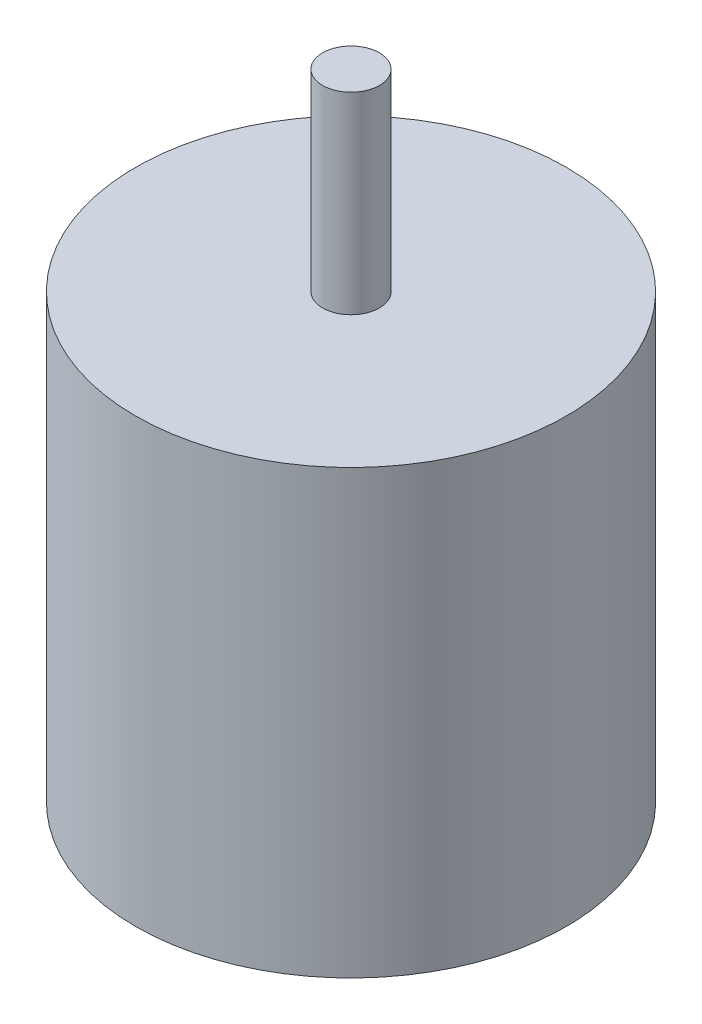
ISO-10303-21;
HEADER;
FILE_DESCRIPTION(('STEP AP214'),'2;1');
FILE_NAME('part.step','',(''),(''),'','','');
FILE_SCHEMA(('AUTOMOTIVE_DESIGN { 1 0 10303 214 1 1 1 1 }'));
ENDSEC;
DATA;
#1=APPLICATION_CONTEXT('core data for automotive mechanical design processes');
#2=APPLICATION_PROTOCOL_DEFINITION('international standard','automotive_design',2000,#1);
#3=PRODUCT_CONTEXT('',#1,'mechanical');
#4=PRODUCT('Part','Part','',(#3));
#5=PRODUCT_RELATED_PRODUCT_CATEGORY('part','',(#4));
#6=PRODUCT_DEFINITION_FORMATION('','',#4);
#7=PRODUCT_DEFINITION_CONTEXT('part definition',#1,'design');
#8=PRODUCT_DEFINITION('design','',#6,#7);
#9=PRODUCT_DEFINITION_SHAPE('','',#8);
#10=(LENGTH_UNIT() NAMED_UNIT(*) SI_UNIT(.MILLI.,.METRE.));
#11=(NAMED_UNIT(*) PLANE_ANGLE_UNIT() SI_UNIT($,.RADIAN.));
#12=(NAMED_UNIT(*) SI_UNIT($,.STERADIAN.) SOLID_ANGLE_UNIT());
#13=UNCERTAINTY_MEASURE_WITH_UNIT(LENGTH_MEASURE(1.E-05),#10,'distance_accuracy_value','');
#14=(GEOMETRIC_REPRESENTATION_CONTEXT(3) GLOBAL_UNCERTAINTY_ASSIGNED_CONTEXT((#13)) GLOBAL_UNIT_ASSIGNED_CONTEXT((#10,
#11,#12)) REPRESENTATION_CONTEXT('',''));
#15=CARTESIAN_POINT('',(0.,0.,0.));
#16=DIRECTION('',(0.,0.,1.));
#17=DIRECTION('',(1.,0.,0.));
#18=AXIS2_PLACEMENT_3D('',#15,#16,#17);
#19=CARTESIAN_POINT('',(0.,39.,0.));
#20=DIRECTION('',(0.,-1.,0.));
#21=DIRECTION('',(0.,0.,1.));
#22=AXIS2_PLACEMENT_3D('',#19,#20,#21);
#23=CYLINDRICAL_SURFACE('',#22,19.);
#24=CARTESIAN_POINT('',(0.,39.,0.));
#25=DIRECTION('',(0.,-1.,0.));
#26=DIRECTION('',(0.,0.,-1.));
#27=AXIS2_PLACEMENT_3D('',#24,#25,#26);
#28=CIRCLE('',#27,19.);
#29=CARTESIAN_POINT('',(0.,39.,-19.));
#30=VERTEX_POINT('',#29);
#31=EDGE_CURVE('E11',#30,#30,#28,.T.);
#32=ORIENTED_EDGE('',*,*,#31,.T.);
#33=EDGE_LOOP('',(#32));
#34=FACE_BOUND('',#33,.T.);
#35=CARTESIAN_POINT('',(0.,0.,0.));
#36=DIRECTION('',(0.,-1.,0.));
#37=DIRECTION('',(0.,0.,-1.));
#38=AXIS2_PLACEMENT_3D('',#35,#36,#37);
#39=CIRCLE('',#38,19.);
#40=CARTESIAN_POINT('',(0.,0.,-19.));
#41=VERTEX_POINT('',#40);
#42=EDGE_CURVE('E40',#41,#41,#39,.T.);
#43=ORIENTED_EDGE('',*,*,#42,.F.);
#44=EDGE_LOOP('',(#43));
#45=FACE_BOUND('',#44,.T.);
#46=ADVANCED_FACE('F37',(#34,#45),#23,.T.);
#47=CARTESIAN_POINT('',(0.,39.,0.));
#48=DIRECTION('',(0.,1.,0.));
#49=DIRECTION('',(0.,0.,-1.));
#50=AXIS2_PLACEMENT_3D('',#47,#48,#49);
#51=PLANE('',#50);
#52=CARTESIAN_POINT('',(0.,39.,0.));
#53=DIRECTION('',(0.,-1.,0.));
#54=DIRECTION('',(0.,0.,-1.));
#55=AXIS2_PLACEMENT_3D('',#52,#53,#54);
#56=CIRCLE('',#55,2.5);
#57=CARTESIAN_POINT('',(0.,39.,-2.5));
#58=VERTEX_POINT('',#57);
#59=EDGE_CURVE('E90',#58,#58,#56,.T.);
#60=ORIENTED_EDGE('',*,*,#59,.T.);
#61=EDGE_LOOP('',(#60));
#62=FACE_BOUND('',#61,.T.);
#63=ORIENTED_EDGE('',*,*,#31,.F.);
#64=EDGE_LOOP('',(#63));
#65=FACE_BOUND('',#64,.T.);
#66=ADVANCED_FACE('F97',(#62,#65),#51,.T.);
#67=CARTESIAN_POINT('',(0.,0.,0.));
#68=DIRECTION('',(0.,1.,0.));
#69=DIRECTION('',(0.,0.,-1.));
#70=AXIS2_PLACEMENT_3D('',#67,#68,#69);
#71=PLANE('',#70);
#72=CARTESIAN_POINT('',(-8.50000000000001,0.,-8.));
#73=DIRECTION('',(0.,1.,0.));
#74=DIRECTION('',(0.,0.,1.));
#75=AXIS2_PLACEMENT_3D('',#72,#73,#74);
#76=CIRCLE('',#75,1.24999999999999);
#77=CARTESIAN_POINT('',(-8.50000000000001,0.,-6.75000000000001));
#78=VERTEX_POINT('',#77);
#79=EDGE_CURVE('E68',#78,#78,#76,.T.);
#80=ORIENTED_EDGE('',*,*,#79,.T.);
#81=EDGE_LOOP('',(#80));
#82=FACE_BOUND('',#81,.T.);
#83=CARTESIAN_POINT('',(-8.50000000000106,0.,7.99999999999994));
#84=DIRECTION('',(0.,1.,0.));
#85=DIRECTION('',(0.,0.,1.));
#86=AXIS2_PLACEMENT_3D('',#83,#84,#85);
#87=CIRCLE('',#86,1.24999999999999);
#88=CARTESIAN_POINT('',(-8.50000000000106,0.,9.24999999999993));
#89=VERTEX_POINT('',#88);
#90=EDGE_CURVE('E67',#89,#89,#87,.T.);
#91=ORIENTED_EDGE('',*,*,#90,.T.);
#92=EDGE_LOOP('',(#91));
#93=FACE_BOUND('',#92,.T.);
#94=CARTESIAN_POINT('',(8.50000000000001,0.,8.00000000000001));
#95=DIRECTION('',(0.,1.,0.));
#96=DIRECTION('',(0.,0.,1.));
#97=AXIS2_PLACEMENT_3D('',#94,#95,#96);
#98=CIRCLE('',#97,1.24999999999999);
#99=CARTESIAN_POINT('',(8.50000000000001,0.,9.25));
#100=VERTEX_POINT('',#99);
#101=EDGE_CURVE('E78',#100,#100,#98,.T.);
#102=ORIENTED_EDGE('',*,*,#101,.T.);
#103=EDGE_LOOP('',(#102));
#104=FACE_BOUND('',#103,.T.);
#105=CARTESIAN_POINT('',(8.50000000000092,0.,-8.));
#106=DIRECTION('',(0.,1.,0.));
#107=DIRECTION('',(0.,0.,1.));
#108=AXIS2_PLACEMENT_3D('',#105,#106,#107);
#109=CIRCLE('',#108,1.24999999999999);
#110=CARTESIAN_POINT('',(8.50000000000092,0.,-6.75000000000001));
#111=VERTEX_POINT('',#110);
#112=EDGE_CURVE('E84',#111,#111,#109,.T.);
#113=ORIENTED_EDGE('',*,*,#112,.T.);
#114=EDGE_LOOP('',(#113));
#115=FACE_BOUND('',#114,.T.);
#116=ORIENTED_EDGE('',*,*,#42,.T.);
#117=EDGE_LOOP('',(#116));
#118=FACE_BOUND('',#117,.T.);
#119=ADVANCED_FACE('F103',(#82,#93,#104,#115,#118),#71,.F.);
#120=CARTESIAN_POINT('',(0.,56.,0.));
#121=DIRECTION('',(0.,-1.,0.));
#122=DIRECTION('',(0.,0.,1.));
#123=AXIS2_PLACEMENT_3D('',#120,#121,#122);
#124=CYLINDRICAL_SURFACE('',#123,2.5);
#125=CARTESIAN_POINT('',(0.,56.,0.));
#126=DIRECTION('',(0.,-1.,0.));
#127=DIRECTION('',(0.,0.,-1.));
#128=AXIS2_PLACEMENT_3D('',#125,#126,#127);
#129=CIRCLE('',#128,2.5);
#130=CARTESIAN_POINT('',(0.,56.,-2.5));
#131=VERTEX_POINT('',#130);
#132=EDGE_CURVE('E91',#131,#131,#129,.T.);
#133=ORIENTED_EDGE('',*,*,#132,.T.);
#134=EDGE_LOOP('',(#133));
#135=FACE_BOUND('',#134,.T.);
#136=ORIENTED_EDGE('',*,*,#59,.F.);
#137=EDGE_LOOP('',(#136));
#138=FACE_BOUND('',#137,.T.);
#139=ADVANCED_FACE('F100',(#135,#138),#124,.T.);
#140=CARTESIAN_POINT('',(0.,56.,0.));
#141=DIRECTION('',(0.,1.,0.));
#142=DIRECTION('',(0.,0.,-1.));
#143=AXIS2_PLACEMENT_3D('',#140,#141,#142);
#144=PLANE('',#143);
#145=ORIENTED_EDGE('',*,*,#132,.F.);
#146=EDGE_LOOP('',(#145));
#147=FACE_BOUND('',#146,.T.);
#148=ADVANCED_FACE('F102',(#147),#144,.T.);
#149=CARTESIAN_POINT('',(8.50000000000092,7.50000000000001,-8.));
#150=DIRECTION('',(0.,-1.,0.));
#151=DIRECTION('',(0.,0.,1.));
#152=AXIS2_PLACEMENT_3D('',#149,#150,#151);
#153=CONICAL_SURFACE('',#152,1.24999999999999,1.02974425867665);
#154=CARTESIAN_POINT('',(8.50000000000092,8.25107577378448,-8.));
#155=VERTEX_POINT('',#154);
#156=VERTEX_LOOP('',#155);
#157=FACE_BOUND('',#156,.T.);
#158=CARTESIAN_POINT('',(8.50000000000092,7.50000000000001,-8.));
#159=DIRECTION('',(0.,1.,0.));
#160=DIRECTION('',(0.,0.,1.));
#161=AXIS2_PLACEMENT_3D('',#158,#159,#160);
#162=CIRCLE('',#161,1.24999999999999);
#163=CARTESIAN_POINT('',(8.50000000000092,7.50000000000001,-6.75000000000001));
#164=VERTEX_POINT('',#163);
#165=EDGE_CURVE('E87',#164,#164,#162,.T.);
#166=ORIENTED_EDGE('',*,*,#165,.F.);
#167=EDGE_LOOP('',(#166));
#168=FACE_BOUND('',#167,.T.);
#169=ADVANCED_FACE('F110',(#157,#168),#153,.F.);
#170=CARTESIAN_POINT('',(8.50000000000092,0.,-8.));
#171=DIRECTION('',(0.,-1.,0.));
#172=DIRECTION('',(0.,0.,1.));
#173=AXIS2_PLACEMENT_3D('',#170,#171,#172);
#174=CYLINDRICAL_SURFACE('',#173,1.24999999999999);
#175=ORIENTED_EDGE('',*,*,#165,.T.);
#176=EDGE_LOOP('',(#175));
#177=FACE_BOUND('',#176,.T.);
#178=ORIENTED_EDGE('',*,*,#112,.F.);
#179=EDGE_LOOP('',(#178));
#180=FACE_BOUND('',#179,.T.);
#181=ADVANCED_FACE('F150',(#177,#180),#174,.F.);
#182=CARTESIAN_POINT('',(8.50000000000001,7.50000000000001,8.00000000000001));
#183=DIRECTION('',(0.,-1.,0.));
#184=DIRECTION('',(0.,0.,1.));
#185=AXIS2_PLACEMENT_3D('',#182,#183,#184);
#186=CONICAL_SURFACE('',#185,1.24999999999999,1.02974425867665);
#187=CARTESIAN_POINT('',(8.50000000000001,8.25107577378448,8.00000000000001));
#188=VERTEX_POINT('',#187);
#189=VERTEX_LOOP('',#188);
#190=FACE_BOUND('',#189,.T.);
#191=CARTESIAN_POINT('',(8.50000000000001,7.50000000000001,8.00000000000001));
#192=DIRECTION('',(0.,1.,0.));
#193=DIRECTION('',(0.,0.,1.));
#194=AXIS2_PLACEMENT_3D('',#191,#192,#193);
#195=CIRCLE('',#194,1.24999999999999);
#196=CARTESIAN_POINT('',(8.50000000000001,7.50000000000001,9.25));
#197=VERTEX_POINT('',#196);
#198=EDGE_CURVE('E81',#197,#197,#195,.T.);
#199=ORIENTED_EDGE('',*,*,#198,.F.);
#200=EDGE_LOOP('',(#199));
#201=FACE_BOUND('',#200,.T.);
#202=ADVANCED_FACE('F159',(#190,#201),#186,.F.);
#203=CARTESIAN_POINT('',(8.50000000000001,0.,8.00000000000001));
#204=DIRECTION('',(0.,-1.,0.));
#205=DIRECTION('',(0.,0.,1.));
#206=AXIS2_PLACEMENT_3D('',#203,#204,#205);
#207=CYLINDRICAL_SURFACE('',#206,1.24999999999999);
#208=ORIENTED_EDGE('',*,*,#198,.T.);
#209=EDGE_LOOP('',(#208));
#210=FACE_BOUND('',#209,.T.);
#211=ORIENTED_EDGE('',*,*,#101,.F.);
#212=EDGE_LOOP('',(#211));
#213=FACE_BOUND('',#212,.T.);
#214=ADVANCED_FACE('F169',(#210,#213),#207,.F.);
#215=CARTESIAN_POINT('',(-8.50000000000106,7.50000000000001,7.99999999999994));
#216=DIRECTION('',(0.,-1.,0.));
#217=DIRECTION('',(0.,0.,1.));
#218=AXIS2_PLACEMENT_3D('',#215,#216,#217);
#219=CONICAL_SURFACE('',#218,1.24999999999999,1.02974425867665);
#220=CARTESIAN_POINT('',(-8.50000000000109,8.25107577378448,7.99999999999994));
#221=VERTEX_POINT('',#220);
#222=VERTEX_LOOP('',#221);
#223=FACE_BOUND('',#222,.T.);
#224=CARTESIAN_POINT('',(-8.50000000000106,7.50000000000001,7.99999999999994));
#225=DIRECTION('',(0.,1.,0.));
#226=DIRECTION('',(0.,0.,1.));
#227=AXIS2_PLACEMENT_3D('',#224,#225,#226);
#228=CIRCLE('',#227,1.24999999999999);
#229=CARTESIAN_POINT('',(-8.50000000000106,7.50000000000001,9.24999999999993));
#230=VERTEX_POINT('',#229);
#231=EDGE_CURVE('E71',#230,#230,#228,.T.);
#232=ORIENTED_EDGE('',*,*,#231,.F.);
#233=EDGE_LOOP('',(#232));
#234=FACE_BOUND('',#233,.T.);
#235=ADVANCED_FACE('F178',(#223,#234),#219,.F.);
#236=CARTESIAN_POINT('',(-8.50000000000106,0.,7.99999999999994));
#237=DIRECTION('',(0.,-1.,0.));
#238=DIRECTION('',(0.,0.,1.));
#239=AXIS2_PLACEMENT_3D('',#236,#237,#238);
#240=CYLINDRICAL_SURFACE('',#239,1.24999999999999);
#241=ORIENTED_EDGE('',*,*,#231,.T.);
#242=EDGE_LOOP('',(#241));
#243=FACE_BOUND('',#242,.T.);
#244=ORIENTED_EDGE('',*,*,#90,.F.);
#245=EDGE_LOOP('',(#244));
#246=FACE_BOUND('',#245,.T.);
#247=ADVANCED_FACE('F61',(#243,#246),#240,.F.);
#248=CARTESIAN_POINT('',(-8.50000000000001,7.50000000000001,-8.));
#249=DIRECTION('',(0.,-1.,0.));
#250=DIRECTION('',(0.,0.,1.));
#251=AXIS2_PLACEMENT_3D('',#248,#249,#250);
#252=CONICAL_SURFACE('',#251,1.24999999999999,1.02974425867665);
#253=CARTESIAN_POINT('',(-8.50000000000001,8.25107577378448,-8.));
#254=VERTEX_POINT('',#253);
#255=VERTEX_LOOP('',#254);
#256=FACE_BOUND('',#255,.T.);
#257=CARTESIAN_POINT('',(-8.50000000000001,7.50000000000001,-8.));
#258=DIRECTION('',(0.,1.,0.));
#259=DIRECTION('',(0.,0.,1.));
#260=AXIS2_PLACEMENT_3D('',#257,#258,#259);
#261=CIRCLE('',#260,1.24999999999999);
#262=CARTESIAN_POINT('',(-8.50000000000001,7.50000000000001,-6.75000000000001));
#263=VERTEX_POINT('',#262);
#264=EDGE_CURVE('E65',#263,#263,#261,.T.);
#265=ORIENTED_EDGE('',*,*,#264,.F.);
#266=EDGE_LOOP('',(#265));
#267=FACE_BOUND('',#266,.T.);
#268=ADVANCED_FACE('F57',(#256,#267),#252,.F.);
#269=CARTESIAN_POINT('',(-8.50000000000001,0.,-8.));
#270=DIRECTION('',(0.,-1.,0.));
#271=DIRECTION('',(0.,0.,1.));
#272=AXIS2_PLACEMENT_3D('',#269,#270,#271);
#273=CYLINDRICAL_SURFACE('',#272,1.24999999999999);
#274=ORIENTED_EDGE('',*,*,#264,.T.);
#275=EDGE_LOOP('',(#274));
#276=FACE_BOUND('',#275,.T.);
#277=ORIENTED_EDGE('',*,*,#79,.F.);
#278=EDGE_LOOP('',(#277));
#279=FACE_BOUND('',#278,.T.);
#280=ADVANCED_FACE('F60',(#276,#279),#273,.F.);
#281=CLOSED_SHELL('',(#46,#66,#119,#139,#148,#169,#181,#202,#214,#235,#247,#268,#280));
#282=MANIFOLD_SOLID_BREP('B2',#281);
#283=ADVANCED_BREP_SHAPE_REPRESENTATION('',(#18,#282),#14);
#284=SHAPE_DEFINITION_REPRESENTATION(#9,#283);
ENDSEC;
END-ISO-10303-21;
